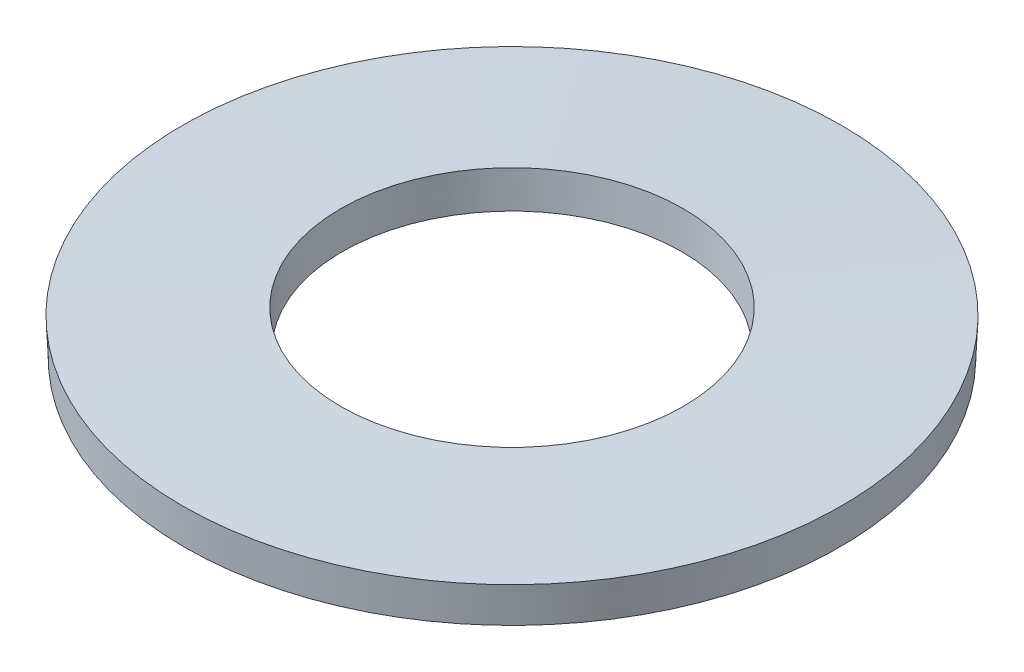
ISO-10303-21;
HEADER;
FILE_DESCRIPTION(('STEP AP214'),'2;1');
FILE_NAME('part.step','',(''),(''),'','','');
FILE_SCHEMA(('AUTOMOTIVE_DESIGN { 1 0 10303 214 1 1 1 1 }'));
ENDSEC;
DATA;
#1=APPLICATION_CONTEXT('core data for automotive mechanical design processes');
#2=APPLICATION_PROTOCOL_DEFINITION('international standard','automotive_design',2000,#1);
#3=PRODUCT_CONTEXT('',#1,'mechanical');
#4=PRODUCT('Part','Part','',(#3));
#5=PRODUCT_RELATED_PRODUCT_CATEGORY('part','',(#4));
#6=PRODUCT_DEFINITION_FORMATION('','',#4);
#7=PRODUCT_DEFINITION_CONTEXT('part definition',#1,'design');
#8=PRODUCT_DEFINITION('design','',#6,#7);
#9=PRODUCT_DEFINITION_SHAPE('','',#8);
#10=(LENGTH_UNIT() NAMED_UNIT(*) SI_UNIT(.MILLI.,.METRE.));
#11=(NAMED_UNIT(*) PLANE_ANGLE_UNIT() SI_UNIT($,.RADIAN.));
#12=(NAMED_UNIT(*) SI_UNIT($,.STERADIAN.) SOLID_ANGLE_UNIT());
#13=UNCERTAINTY_MEASURE_WITH_UNIT(LENGTH_MEASURE(1.E-05),#10,'distance_accuracy_value','');
#14=(GEOMETRIC_REPRESENTATION_CONTEXT(3) GLOBAL_UNCERTAINTY_ASSIGNED_CONTEXT((#13)) GLOBAL_UNIT_ASSIGNED_CONTEXT((#10,
#11,#12)) REPRESENTATION_CONTEXT('',''));
#15=CARTESIAN_POINT('',(0.,0.,0.));
#16=DIRECTION('',(0.,0.,1.));
#17=DIRECTION('',(1.,0.,0.));
#18=AXIS2_PLACEMENT_3D('',#15,#16,#17);
#19=CARTESIAN_POINT('',(0.,2.08623646755056,0.));
#20=DIRECTION('',(0.,1.,0.));
#21=DIRECTION('',(0.,0.,1.));
#22=AXIS2_PLACEMENT_3D('',#19,#20,#21);
#23=CONICAL_SURFACE('',#22,8.22738344429636,0.0441849802430376);
#24=CARTESIAN_POINT('',(0.,0.336024553290059,0.));
#25=DIRECTION('',(0.,-1.,0.));
#26=DIRECTION('',(0.,0.,-1.));
#27=AXIS2_PLACEMENT_3D('',#24,#25,#26);
#28=CIRCLE('',#27,8.15);
#29=CARTESIAN_POINT('',(0.,0.336024553290059,-8.15));
#30=VERTEX_POINT('',#29);
#31=EDGE_CURVE('E28',#30,#30,#28,.T.);
#32=ORIENTED_EDGE('',*,*,#31,.T.);
#33=EDGE_LOOP('',(#32));
#34=FACE_BOUND('',#33,.T.);
#35=CARTESIAN_POINT('',(0.,2.08623646755056,0.));
#36=DIRECTION('',(0.,-1.,0.));
#37=DIRECTION('',(0.,0.,-1.));
#38=AXIS2_PLACEMENT_3D('',#35,#36,#37);
#39=CIRCLE('',#38,8.22738344429636);
#40=CARTESIAN_POINT('',(0.,2.08623646755056,-8.22738344429636));
#41=VERTEX_POINT('',#40);
#42=EDGE_CURVE('E10',#41,#41,#39,.T.);
#43=ORIENTED_EDGE('',*,*,#42,.F.);
#44=EDGE_LOOP('',(#43));
#45=FACE_BOUND('',#44,.T.);
#46=ADVANCED_FACE('F14',(#34,#45),#23,.F.);
#47=CARTESIAN_POINT('',(0.,1.75021191426051,0.));
#48=DIRECTION('',(0.,-1.,0.));
#49=DIRECTION('',(0.,0.,-1.));
#50=AXIS2_PLACEMENT_3D('',#47,#48,#49);
#51=CONICAL_SURFACE('',#50,15.8273834442964,1.52661134655186);
#52=ORIENTED_EDGE('',*,*,#42,.T.);
#53=EDGE_LOOP('',(#52));
#54=FACE_BOUND('',#53,.T.);
#55=CARTESIAN_POINT('',(0.,1.75021191426051,0.));
#56=DIRECTION('',(0.,-1.,0.));
#57=DIRECTION('',(0.,0.,-1.));
#58=AXIS2_PLACEMENT_3D('',#55,#56,#57);
#59=CIRCLE('',#58,15.8273834442964);
#60=CARTESIAN_POINT('',(0.,1.75021191426051,-15.8273834442964));
#61=VERTEX_POINT('',#60);
#62=EDGE_CURVE('E20',#61,#61,#59,.T.);
#63=ORIENTED_EDGE('',*,*,#62,.F.);
#64=EDGE_LOOP('',(#63));
#65=FACE_BOUND('',#64,.T.);
#66=ADVANCED_FACE('F44',(#54,#65),#51,.T.);
#67=CARTESIAN_POINT('',(0.,0.,0.));
#68=DIRECTION('',(0.,1.,0.));
#69=DIRECTION('',(0.,0.,1.));
#70=AXIS2_PLACEMENT_3D('',#67,#68,#69);
#71=CONICAL_SURFACE('',#70,15.75,0.0441849802430366);
#72=ORIENTED_EDGE('',*,*,#62,.T.);
#73=EDGE_LOOP('',(#72));
#74=FACE_BOUND('',#73,.T.);
#75=CARTESIAN_POINT('',(0.,0.,0.));
#76=DIRECTION('',(0.,-1.,0.));
#77=DIRECTION('',(0.,0.,-1.));
#78=AXIS2_PLACEMENT_3D('',#75,#76,#77);
#79=CIRCLE('',#78,15.75);
#80=CARTESIAN_POINT('',(0.,0.,-15.75));
#81=VERTEX_POINT('',#80);
#82=EDGE_CURVE('E24',#81,#81,#79,.T.);
#83=ORIENTED_EDGE('',*,*,#82,.F.);
#84=EDGE_LOOP('',(#83));
#85=FACE_BOUND('',#84,.T.);
#86=ADVANCED_FACE('F39',(#74,#85),#71,.T.);
#87=CARTESIAN_POINT('',(0.,0.,0.));
#88=DIRECTION('',(0.,-1.,0.));
#89=DIRECTION('',(0.,0.,-1.));
#90=AXIS2_PLACEMENT_3D('',#87,#88,#89);
#91=CONICAL_SURFACE('',#90,15.75,1.52661134655186);
#92=ORIENTED_EDGE('',*,*,#31,.F.);
#93=EDGE_LOOP('',(#92));
#94=FACE_BOUND('',#93,.T.);
#95=ORIENTED_EDGE('',*,*,#82,.T.);
#96=EDGE_LOOP('',(#95));
#97=FACE_BOUND('',#96,.T.);
#98=ADVANCED_FACE('F36',(#94,#97),#91,.F.);
#99=CLOSED_SHELL('',(#46,#66,#86,#98));
#100=MANIFOLD_SOLID_BREP('B1',#99);
#101=ADVANCED_BREP_SHAPE_REPRESENTATION('',(#18,#100),#14);
#102=SHAPE_DEFINITION_REPRESENTATION(#9,#101);
ENDSEC;
END-ISO-10303-21;
